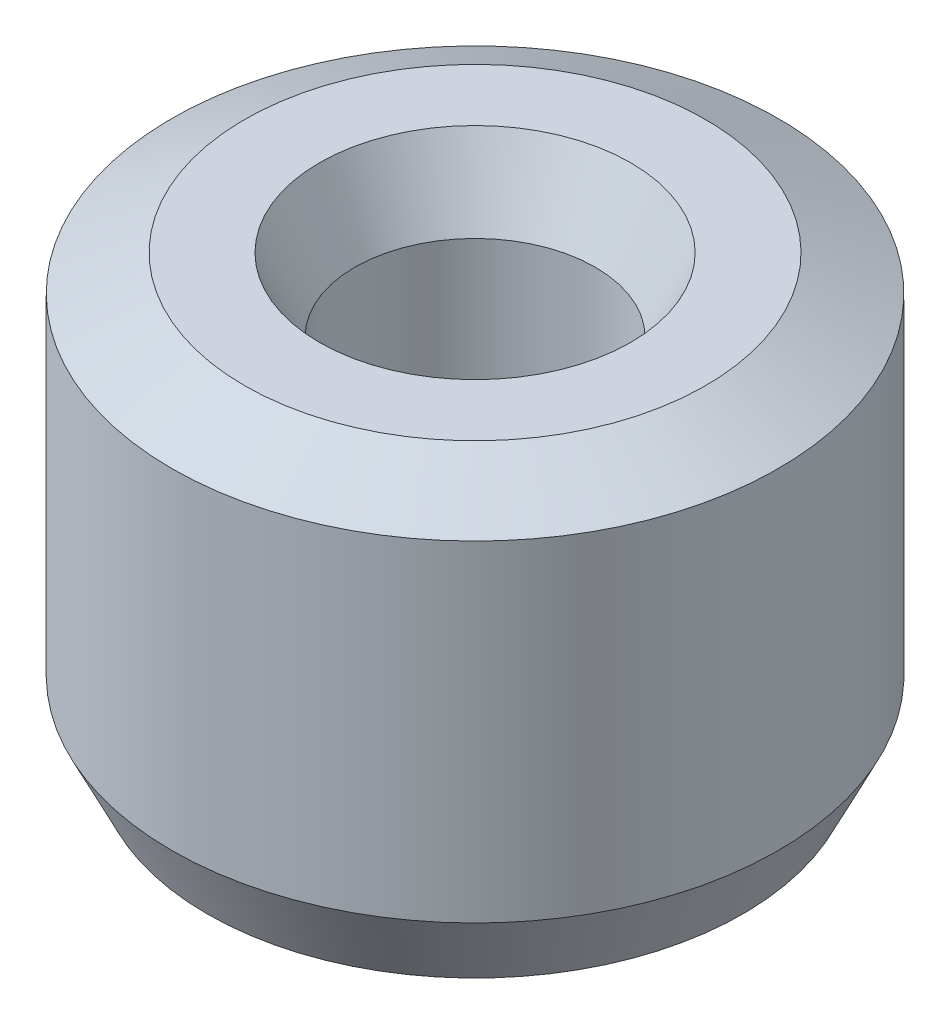
ISO-10303-21;
HEADER;
FILE_DESCRIPTION(('STEP AP214'),'2;1');
FILE_NAME('part.step','',(''),(''),'','','');
FILE_SCHEMA(('AUTOMOTIVE_DESIGN { 1 0 10303 214 1 1 1 1 }'));
ENDSEC;
DATA;
#1=APPLICATION_CONTEXT('core data for automotive mechanical design processes');
#2=APPLICATION_PROTOCOL_DEFINITION('international standard','automotive_design',2000,#1);
#3=PRODUCT_CONTEXT('',#1,'mechanical');
#4=PRODUCT('Part','Part','',(#3));
#5=PRODUCT_RELATED_PRODUCT_CATEGORY('part','',(#4));
#6=PRODUCT_DEFINITION_FORMATION('','',#4);
#7=PRODUCT_DEFINITION_CONTEXT('part definition',#1,'design');
#8=PRODUCT_DEFINITION('design','',#6,#7);
#9=PRODUCT_DEFINITION_SHAPE('','',#8);
#10=(LENGTH_UNIT() NAMED_UNIT(*) SI_UNIT(.MILLI.,.METRE.));
#11=(NAMED_UNIT(*) PLANE_ANGLE_UNIT() SI_UNIT($,.RADIAN.));
#12=(NAMED_UNIT(*) SI_UNIT($,.STERADIAN.) SOLID_ANGLE_UNIT());
#13=UNCERTAINTY_MEASURE_WITH_UNIT(LENGTH_MEASURE(1.E-05),#10,'distance_accuracy_value','');
#14=(GEOMETRIC_REPRESENTATION_CONTEXT(3) GLOBAL_UNCERTAINTY_ASSIGNED_CONTEXT((#13)) GLOBAL_UNIT_ASSIGNED_CONTEXT((#10,
#11,#12)) REPRESENTATION_CONTEXT('',''));
#15=CARTESIAN_POINT('',(0.,0.,0.));
#16=DIRECTION('',(0.,0.,1.));
#17=DIRECTION('',(1.,0.,0.));
#18=AXIS2_PLACEMENT_3D('',#15,#16,#17);
#19=CARTESIAN_POINT('',(0.,18.094022057992,0.));
#20=DIRECTION('',(0.,-1.,0.));
#21=DIRECTION('',(0.,0.,-1.));
#22=AXIS2_PLACEMENT_3D('',#19,#20,#21);
#23=CYLINDRICAL_SURFACE('',#22,12.5);
#24=CARTESIAN_POINT('',(0.,2.99796470663056,0.));
#25=DIRECTION('',(0.,1.,0.));
#26=DIRECTION('',(0.,0.,1.));
#27=AXIS2_PLACEMENT_3D('',#24,#25,#26);
#28=CIRCLE('',#27,12.5);
#29=CARTESIAN_POINT('',(0.,2.99796470663056,12.5));
#30=VERTEX_POINT('',#29);
#31=EDGE_CURVE('E10',#30,#30,#28,.T.);
#32=ORIENTED_EDGE('',*,*,#31,.T.);
#33=EDGE_LOOP('',(#32));
#34=FACE_BOUND('',#33,.T.);
#35=CARTESIAN_POINT('',(0.,16.6335009616495,0.));
#36=DIRECTION('',(0.,1.,0.));
#37=DIRECTION('',(0.,0.,1.));
#38=AXIS2_PLACEMENT_3D('',#35,#36,#37);
#39=CIRCLE('',#38,12.5);
#40=CARTESIAN_POINT('',(0.,16.6335009616495,12.5));
#41=VERTEX_POINT('',#40);
#42=EDGE_CURVE('E50',#41,#41,#39,.F.);
#43=ORIENTED_EDGE('',*,*,#42,.T.);
#44=EDGE_LOOP('',(#43));
#45=FACE_BOUND('',#44,.T.);
#46=ADVANCED_FACE('F39',(#34,#45),#23,.T.);
#47=CARTESIAN_POINT('',(0.,18.094022057992,0.));
#48=DIRECTION('',(0.,1.,0.));
#49=DIRECTION('',(0.,0.,1.));
#50=AXIS2_PLACEMENT_3D('',#47,#48,#49);
#51=PLANE('',#50);
#52=CARTESIAN_POINT('',(0.,18.094022057992,0.));
#53=DIRECTION('',(0.,1.,0.));
#54=DIRECTION('',(0.,0.,1.));
#55=AXIS2_PLACEMENT_3D('',#52,#53,#54);
#56=CIRCLE('',#55,6.41567334815517);
#57=CARTESIAN_POINT('',(0.,18.094022057992,6.41567334815517));
#58=VERTEX_POINT('',#57);
#59=EDGE_CURVE('E58',#58,#58,#56,.F.);
#60=ORIENTED_EDGE('',*,*,#59,.T.);
#61=EDGE_LOOP('',(#60));
#62=FACE_BOUND('',#61,.T.);
#63=CARTESIAN_POINT('',(0.,18.094022057992,0.));
#64=DIRECTION('',(0.,1.,0.));
#65=DIRECTION('',(0.,0.,1.));
#66=AXIS2_PLACEMENT_3D('',#63,#64,#65);
#67=CIRCLE('',#66,9.50203529336947);
#68=CARTESIAN_POINT('',(0.,18.094022057992,9.50203529336947));
#69=VERTEX_POINT('',#68);
#70=EDGE_CURVE('E61',#69,#69,#67,.T.);
#71=ORIENTED_EDGE('',*,*,#70,.T.);
#72=EDGE_LOOP('',(#71));
#73=FACE_BOUND('',#72,.T.);
#74=ADVANCED_FACE('F88',(#62,#73),#51,.T.);
#75=CARTESIAN_POINT('',(0.,0.,0.));
#76=DIRECTION('',(0.,1.,0.));
#77=DIRECTION('',(0.,0.,1.));
#78=AXIS2_PLACEMENT_3D('',#75,#76,#77);
#79=PLANE('',#78);
#80=CARTESIAN_POINT('',(0.,0.,0.));
#81=DIRECTION('',(0.,1.,0.));
#82=DIRECTION('',(0.,0.,1.));
#83=AXIS2_PLACEMENT_3D('',#80,#81,#82);
#84=CIRCLE('',#83,7.95311695844318);
#85=CARTESIAN_POINT('',(0.,0.,7.95311695844318));
#86=VERTEX_POINT('',#85);
#87=EDGE_CURVE('E51',#86,#86,#84,.T.);
#88=ORIENTED_EDGE('',*,*,#87,.T.);
#89=EDGE_LOOP('',(#88));
#90=FACE_BOUND('',#89,.T.);
#91=CARTESIAN_POINT('',(0.,0.,0.));
#92=DIRECTION('',(0.,1.,0.));
#93=DIRECTION('',(0.,0.,1.));
#94=AXIS2_PLACEMENT_3D('',#91,#92,#93);
#95=CIRCLE('',#94,11.0394789036575);
#96=CARTESIAN_POINT('',(0.,0.,11.0394789036575));
#97=VERTEX_POINT('',#96);
#98=EDGE_CURVE('E54',#97,#97,#95,.F.);
#99=ORIENTED_EDGE('',*,*,#98,.T.);
#100=EDGE_LOOP('',(#99));
#101=FACE_BOUND('',#100,.T.);
#102=ADVANCED_FACE('F83',(#90,#101),#79,.F.);
#103=CARTESIAN_POINT('',(0.,18.094022057992,0.));
#104=DIRECTION('',(0.,-1.,0.));
#105=DIRECTION('',(0.,0.,-1.));
#106=AXIS2_PLACEMENT_3D('',#103,#104,#105);
#107=CYLINDRICAL_SURFACE('',#106,4.95515225181264);
#108=CARTESIAN_POINT('',(0.,15.0960573513614,0.));
#109=DIRECTION('',(0.,1.,0.));
#110=DIRECTION('',(0.,0.,1.));
#111=AXIS2_PLACEMENT_3D('',#108,#109,#110);
#112=CIRCLE('',#111,4.95515225181264);
#113=CARTESIAN_POINT('',(0.,15.0960573513614,4.95515225181264));
#114=VERTEX_POINT('',#113);
#115=EDGE_CURVE('E67',#114,#114,#112,.T.);
#116=ORIENTED_EDGE('',*,*,#115,.T.);
#117=EDGE_LOOP('',(#116));
#118=FACE_BOUND('',#117,.T.);
#119=CARTESIAN_POINT('',(0.,1.46052109634254,0.));
#120=DIRECTION('',(0.,1.,0.));
#121=DIRECTION('',(0.,0.,1.));
#122=AXIS2_PLACEMENT_3D('',#119,#120,#121);
#123=CIRCLE('',#122,4.95515225181264);
#124=CARTESIAN_POINT('',(0.,1.46052109634254,4.95515225181264));
#125=VERTEX_POINT('',#124);
#126=EDGE_CURVE('E69',#125,#125,#123,.F.);
#127=ORIENTED_EDGE('',*,*,#126,.T.);
#128=EDGE_LOOP('',(#127));
#129=FACE_BOUND('',#128,.T.);
#130=ADVANCED_FACE('F71',(#118,#129),#107,.F.);
#131=CARTESIAN_POINT('',(0.,15.0960573513614,0.));
#132=DIRECTION('',(0.,1.,0.));
#133=DIRECTION('',(0.,0.,1.));
#134=AXIS2_PLACEMENT_3D('',#131,#132,#133);
#135=CONICAL_SURFACE('',#134,4.95515225181264,0.453331737501259);
#136=ORIENTED_EDGE('',*,*,#59,.F.);
#137=EDGE_LOOP('',(#136));
#138=FACE_BOUND('',#137,.T.);
#139=ORIENTED_EDGE('',*,*,#115,.F.);
#140=EDGE_LOOP('',(#139));
#141=FACE_BOUND('',#140,.T.);
#142=ADVANCED_FACE('F77',(#138,#141),#135,.F.);
#143=CARTESIAN_POINT('',(0.,0.,0.));
#144=DIRECTION('',(0.,-1.,0.));
#145=DIRECTION('',(0.,0.,-1.));
#146=AXIS2_PLACEMENT_3D('',#143,#144,#145);
#147=CONICAL_SURFACE('',#146,7.95311695844318,1.11746458929364);
#148=ORIENTED_EDGE('',*,*,#126,.F.);
#149=EDGE_LOOP('',(#148));
#150=FACE_BOUND('',#149,.T.);
#151=ORIENTED_EDGE('',*,*,#87,.F.);
#152=EDGE_LOOP('',(#151));
#153=FACE_BOUND('',#152,.T.);
#154=ADVANCED_FACE('F73',(#150,#153),#147,.F.);
#155=CARTESIAN_POINT('',(0.,2.99796470663056,0.));
#156=DIRECTION('',(0.,1.,0.));
#157=DIRECTION('',(0.,0.,1.));
#158=AXIS2_PLACEMENT_3D('',#155,#156,#157);
#159=CONICAL_SURFACE('',#158,12.5,0.45333173750126);
#160=ORIENTED_EDGE('',*,*,#98,.F.);
#161=EDGE_LOOP('',(#160));
#162=FACE_BOUND('',#161,.T.);
#163=ORIENTED_EDGE('',*,*,#31,.F.);
#164=EDGE_LOOP('',(#163));
#165=FACE_BOUND('',#164,.T.);
#166=ADVANCED_FACE('F76',(#162,#165),#159,.T.);
#167=CARTESIAN_POINT('',(0.,18.094022057992,0.));
#168=DIRECTION('',(0.,-1.,0.));
#169=DIRECTION('',(0.,0.,-1.));
#170=AXIS2_PLACEMENT_3D('',#167,#168,#169);
#171=CONICAL_SURFACE('',#170,9.50203529336947,1.11746458929364);
#172=ORIENTED_EDGE('',*,*,#42,.F.);
#173=EDGE_LOOP('',(#172));
#174=FACE_BOUND('',#173,.T.);
#175=ORIENTED_EDGE('',*,*,#70,.F.);
#176=EDGE_LOOP('',(#175));
#177=FACE_BOUND('',#176,.T.);
#178=ADVANCED_FACE('F45',(#174,#177),#171,.T.);
#179=CLOSED_SHELL('',(#46,#74,#102,#130,#142,#154,#166,#178));
#180=MANIFOLD_SOLID_BREP('B2',#179);
#181=ADVANCED_BREP_SHAPE_REPRESENTATION('',(#18,#180),#14);
#182=SHAPE_DEFINITION_REPRESENTATION(#9,#181);
ENDSEC;
END-ISO-10303-21;
